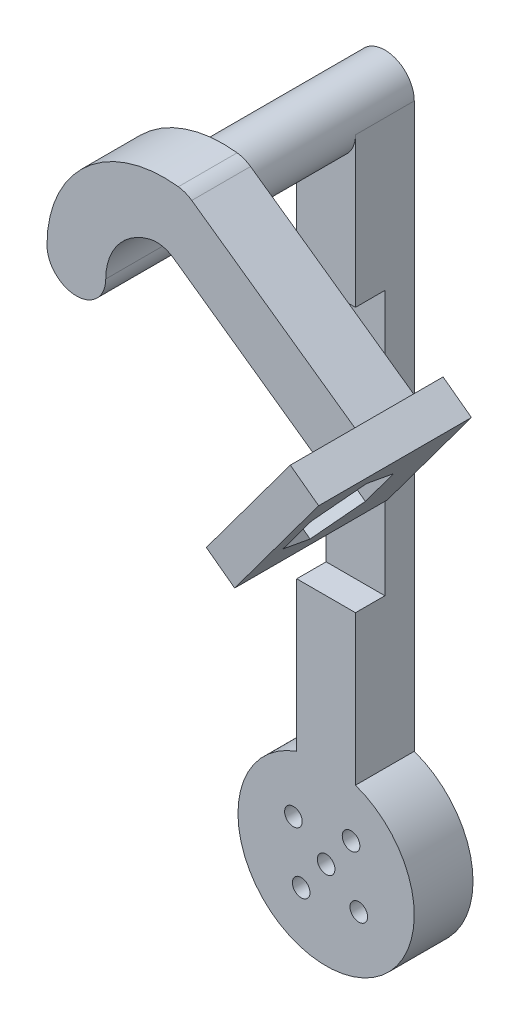
ISO-10303-21;
HEADER;
FILE_DESCRIPTION(('STEP AP214'),'2;1');
FILE_NAME('part.step','',(''),(''),'','','');
FILE_SCHEMA(('AUTOMOTIVE_DESIGN { 1 0 10303 214 1 1 1 1 }'));
ENDSEC;
DATA;
#1=APPLICATION_CONTEXT('core data for automotive mechanical design processes');
#2=APPLICATION_PROTOCOL_DEFINITION('international standard','automotive_design',2000,#1);
#3=PRODUCT_CONTEXT('',#1,'mechanical');
#4=PRODUCT('Part','Part','',(#3));
#5=PRODUCT_RELATED_PRODUCT_CATEGORY('part','',(#4));
#6=PRODUCT_DEFINITION_FORMATION('','',#4);
#7=PRODUCT_DEFINITION_CONTEXT('part definition',#1,'design');
#8=PRODUCT_DEFINITION('design','',#6,#7);
#9=PRODUCT_DEFINITION_SHAPE('','',#8);
#10=(LENGTH_UNIT() NAMED_UNIT(*) SI_UNIT(.MILLI.,.METRE.));
#11=(NAMED_UNIT(*) PLANE_ANGLE_UNIT() SI_UNIT($,.RADIAN.));
#12=(NAMED_UNIT(*) SI_UNIT($,.STERADIAN.) SOLID_ANGLE_UNIT());
#13=UNCERTAINTY_MEASURE_WITH_UNIT(LENGTH_MEASURE(1.E-05),#10,'distance_accuracy_value','');
#14=(GEOMETRIC_REPRESENTATION_CONTEXT(3) GLOBAL_UNCERTAINTY_ASSIGNED_CONTEXT((#13)) GLOBAL_UNIT_ASSIGNED_CONTEXT((#10,
#11,#12)) REPRESENTATION_CONTEXT('',''));
#15=CARTESIAN_POINT('',(0.,0.,0.));
#16=DIRECTION('',(0.,0.,1.));
#17=DIRECTION('',(1.,0.,0.));
#18=AXIS2_PLACEMENT_3D('',#15,#16,#17);
#19=CARTESIAN_POINT('',(-5.,70.,-42.5));
#20=DIRECTION('',(0.,0.,-1.));
#21=DIRECTION('',(1.,0.,0.));
#22=AXIS2_PLACEMENT_3D('',#19,#20,#21);
#23=PLANE('',#22);
#24=CARTESIAN_POINT('',(-4.99999999999998,-40.,-42.5));
#25=DIRECTION('',(0.,0.,-1.));
#26=DIRECTION('',(-1.,0.,0.));
#27=AXIS2_PLACEMENT_3D('',#24,#25,#26);
#28=CIRCLE('',#27,1.5);
#29=CARTESIAN_POINT('',(-6.49999999999998,-40.,-42.5));
#30=VERTEX_POINT('',#29);
#31=EDGE_CURVE('E345',#30,#30,#28,.T.);
#32=ORIENTED_EDGE('',*,*,#31,.T.);
#33=EDGE_LOOP('',(#32));
#34=FACE_BOUND('',#33,.T.);
#35=CARTESIAN_POINT('',(-10.5656613127386,-35.7546008253776,-42.5));
#36=DIRECTION('',(0.,0.,-1.));
#37=DIRECTION('',(-1.,0.,0.));
#38=AXIS2_PLACEMENT_3D('',#35,#36,#37);
#39=CIRCLE('',#38,1.5);
#40=CARTESIAN_POINT('',(-12.0656613127386,-35.7546008253776,-42.5));
#41=VERTEX_POINT('',#40);
#42=EDGE_CURVE('E346',#41,#41,#39,.T.);
#43=ORIENTED_EDGE('',*,*,#42,.T.);
#44=EDGE_LOOP('',(#43));
#45=FACE_BOUND('',#44,.T.);
#46=CARTESIAN_POINT('',(-0.754600825377485,-34.4343386872617,-42.5));
#47=DIRECTION('',(0.,0.,-1.));
#48=DIRECTION('',(-1.,0.,0.));
#49=AXIS2_PLACEMENT_3D('',#46,#47,#48);
#50=CIRCLE('',#49,1.50000000000032);
#51=CARTESIAN_POINT('',(-2.2546008253778,-34.4343386872617,-42.5));
#52=VERTEX_POINT('',#51);
#53=EDGE_CURVE('E352',#52,#52,#50,.T.);
#54=ORIENTED_EDGE('',*,*,#53,.T.);
#55=EDGE_LOOP('',(#54));
#56=FACE_BOUND('',#55,.T.);
#57=CARTESIAN_POINT('',(0.565661312738365,-44.2453991746228,-42.5));
#58=DIRECTION('',(0.,0.,-1.));
#59=DIRECTION('',(-1.,0.,0.));
#60=AXIS2_PLACEMENT_3D('',#57,#58,#59);
#61=CIRCLE('',#60,1.50000000000042);
#62=CARTESIAN_POINT('',(-0.934338687262058,-44.2453991746228,-42.5));
#63=VERTEX_POINT('',#62);
#64=EDGE_CURVE('E358',#63,#63,#61,.T.);
#65=ORIENTED_EDGE('',*,*,#64,.T.);
#66=EDGE_LOOP('',(#65));
#67=FACE_BOUND('',#66,.T.);
#68=CARTESIAN_POINT('',(-9.24539917462271,-45.5656613127386,-42.5));
#69=DIRECTION('',(0.,0.,-1.));
#70=DIRECTION('',(-1.,0.,0.));
#71=AXIS2_PLACEMENT_3D('',#68,#69,#70);
#72=CIRCLE('',#71,1.50000000000016);
#73=CARTESIAN_POINT('',(-10.7453991746229,-45.5656613127386,-42.5));
#74=VERTEX_POINT('',#73);
#75=EDGE_CURVE('E341',#74,#74,#72,.T.);
#76=ORIENTED_EDGE('',*,*,#75,.T.);
#77=EDGE_LOOP('',(#76));
#78=FACE_BOUND('',#77,.T.);
#79=DIRECTION('',(0.,-1.,0.));
#80=VECTOR('',#79,1.);
#81=CARTESIAN_POINT('',(-10.,70.,-42.5));
#82=LINE('',#81,#80);
#83=CARTESIAN_POINT('',(-10.,-0.428932188134513,-42.5));
#84=VERTEX_POINT('',#83);
#85=CARTESIAN_POINT('',(-9.99999999999999,-25.8578643762691,-42.5));
#86=VERTEX_POINT('',#85);
#87=EDGE_CURVE('E369',#84,#86,#82,.T.);
#88=ORIENTED_EDGE('',*,*,#87,.T.);
#89=CARTESIAN_POINT('',(-4.99999999999999,-40.,-42.5));
#90=DIRECTION('',(0.,0.,1.));
#91=DIRECTION('',(1.,0.,0.));
#92=AXIS2_PLACEMENT_3D('',#89,#90,#91);
#93=CIRCLE('',#92,15.);
#94=CARTESIAN_POINT('',(0.,-25.857864376269,-42.5));
#95=VERTEX_POINT('',#94);
#96=EDGE_CURVE('E388',#86,#95,#93,.T.);
#97=ORIENTED_EDGE('',*,*,#96,.T.);
#98=DIRECTION('',(0.,1.,0.));
#99=VECTOR('',#98,1.);
#100=CARTESIAN_POINT('',(0.,70.,-42.5));
#101=LINE('',#100,#99);
#102=CARTESIAN_POINT('',(0.,-0.428932188134511,-42.5));
#103=VERTEX_POINT('',#102);
#104=EDGE_CURVE('E376',#95,#103,#101,.T.);
#105=ORIENTED_EDGE('',*,*,#104,.T.);
#106=DIRECTION('',(-1.,0.,0.));
#107=VECTOR('',#106,1.);
#108=CARTESIAN_POINT('',(0.,-0.428932188134511,-42.5));
#109=LINE('',#108,#107);
#110=EDGE_CURVE('E232',#103,#84,#109,.T.);
#111=ORIENTED_EDGE('',*,*,#110,.T.);
#112=EDGE_LOOP('',(#88,#97,#105,#111));
#113=FACE_BOUND('',#112,.T.);
#114=ADVANCED_FACE('F37',(#34,#45,#56,#67,#78,#113),#23,.F.);
#115=CARTESIAN_POINT('',(46.8101040062718,66.1183287171004,-10.));
#116=DIRECTION('',(0.577822415053882,0.816162518534942,0.));
#117=DIRECTION('',(-0.816162518534942,0.577822415053882,0.));
#118=AXIS2_PLACEMENT_3D('',#115,#116,#117);
#119=PLANE('',#118);
#120=DIRECTION('',(0.816162518534942,-0.577822415053882,0.));
#121=VECTOR('',#120,1.);
#122=CARTESIAN_POINT('',(46.8101040062718,66.1183287171004,-10.));
#123=LINE('',#122,#121);
#124=CARTESIAN_POINT('',(14.6370161563222,88.8960609689677,-10.));
#125=VERTEX_POINT('',#124);
#126=CARTESIAN_POINT('',(43.2377237554058,68.6474835571825,-10.));
#127=VERTEX_POINT('',#126);
#128=EDGE_CURVE('E412',#125,#127,#123,.T.);
#129=ORIENTED_EDGE('',*,*,#128,.F.);
#130=DIRECTION('',(0.,0.,1.));
#131=VECTOR('',#130,1.);
#132=CARTESIAN_POINT('',(14.6370161563222,88.8960609689677,-10.));
#133=LINE('',#132,#131);
#134=CARTESIAN_POINT('',(14.6370161563222,88.8960609689677,0.));
#135=VERTEX_POINT('',#134);
#136=EDGE_CURVE('E457',#125,#135,#133,.T.);
#137=ORIENTED_EDGE('',*,*,#136,.T.);
#138=DIRECTION('',(0.816162518534942,-0.577822415053882,0.));
#139=VECTOR('',#138,1.);
#140=CARTESIAN_POINT('',(46.8101040062718,66.1183287171004,0.));
#141=LINE('',#140,#139);
#142=CARTESIAN_POINT('',(43.2377237554058,68.6474835571825,0.));
#143=VERTEX_POINT('',#142);
#144=EDGE_CURVE('E409',#135,#143,#141,.T.);
#145=ORIENTED_EDGE('',*,*,#144,.T.);
#146=DIRECTION('',(0.,0.,1.));
#147=VECTOR('',#146,1.);
#148=CARTESIAN_POINT('',(43.2377237554058,68.6474835571825,-10.));
#149=LINE('',#148,#147);
#150=EDGE_CURVE('E315',#127,#143,#149,.T.);
#151=ORIENTED_EDGE('',*,*,#150,.F.);
#152=EDGE_LOOP('',(#129,#137,#145,#151));
#153=FACE_BOUND('',#152,.T.);
#154=ADVANCED_FACE('F39',(#153),#119,.T.);
#155=CARTESIAN_POINT('',(41.031879855733,57.956703531751,-10.));
#156=DIRECTION('',(0.577822415053882,0.816162518534942,0.));
#157=DIRECTION('',(-0.816162518534942,0.577822415053882,0.));
#158=AXIS2_PLACEMENT_3D('',#155,#156,#157);
#159=PLANE('',#158);
#160=DIRECTION('',(0.,0.,1.));
#161=VECTOR('',#160,1.);
#162=CARTESIAN_POINT('',(37.282165609397,60.6114063542588,-10.));
#163=LINE('',#162,#161);
#164=CARTESIAN_POINT('',(37.282165609397,60.6114063542588,-10.));
#165=VERTEX_POINT('',#164);
#166=CARTESIAN_POINT('',(37.282165609397,60.6114063542588,0.));
#167=VERTEX_POINT('',#166);
#168=EDGE_CURVE('E312',#165,#167,#163,.T.);
#169=ORIENTED_EDGE('',*,*,#168,.T.);
#170=DIRECTION('',(0.816162518534942,-0.577822415053882,0.));
#171=VECTOR('',#170,1.);
#172=CARTESIAN_POINT('',(41.031879855733,57.956703531751,0.));
#173=LINE('',#172,#171);
#174=CARTESIAN_POINT('',(11.5366284211116,78.8385953480618,0.));
#175=VERTEX_POINT('',#174);
#176=EDGE_CURVE('E416',#175,#167,#173,.T.);
#177=ORIENTED_EDGE('',*,*,#176,.F.);
#178=DIRECTION('',(0.,0.,1.));
#179=VECTOR('',#178,1.);
#180=CARTESIAN_POINT('',(11.5366284211116,78.8385953480618,-10.));
#181=LINE('',#180,#179);
#182=CARTESIAN_POINT('',(11.5366284211116,78.8385953480618,-10.));
#183=VERTEX_POINT('',#182);
#184=EDGE_CURVE('E431',#183,#175,#181,.T.);
#185=ORIENTED_EDGE('',*,*,#184,.F.);
#186=DIRECTION('',(0.816162518534942,-0.577822415053882,0.));
#187=VECTOR('',#186,1.);
#188=CARTESIAN_POINT('',(41.031879855733,57.956703531751,-10.));
#189=LINE('',#188,#187);
#190=EDGE_CURVE('E428',#183,#165,#189,.T.);
#191=ORIENTED_EDGE('',*,*,#190,.T.);
#192=EDGE_LOOP('',(#169,#177,#185,#191));
#193=FACE_BOUND('',#192,.T.);
#194=ADVANCED_FACE('F502',(#193),#159,.F.);
#195=CARTESIAN_POINT('',(0.,0.,0.));
#196=DIRECTION('',(0.,0.,-1.));
#197=DIRECTION('',(1.,0.,0.));
#198=AXIS2_PLACEMENT_3D('',#195,#196,#197);
#199=PLANE('',#198);
#200=DIRECTION('',(0.595415284473228,0.803418097266713,0.));
#201=VECTOR('',#200,1.);
#202=CARTESIAN_POINT('',(47.4079851150517,74.2745870831456,0.));
#203=LINE('',#202,#201);
#204=CARTESIAN_POINT('',(37.3410147158261,60.6908138507508,0.));
#205=VERTEX_POINT('',#204);
#206=EDGE_CURVE('E45',#167,#205,#203,.T.);
#207=ORIENTED_EDGE('',*,*,#206,.T.);
#208=CARTESIAN_POINT('',(43.18498868692,68.5763259811395,0.));
#209=VERTEX_POINT('',#208);
#210=EDGE_CURVE('E332',#205,#209,#203,.T.);
#211=ORIENTED_EDGE('',*,*,#210,.T.);
#212=EDGE_CURVE('E333',#209,#143,#203,.T.);
#213=ORIENTED_EDGE('',*,*,#212,.T.);
#214=ORIENTED_EDGE('',*,*,#144,.F.);
#215=CARTESIAN_POINT('',(11.7479040810528,84.815248376293,0.));
#216=DIRECTION('',(0.,0.,1.));
#217=DIRECTION('',(1.,0.,0.));
#218=AXIS2_PLACEMENT_3D('',#215,#216,#217);
#219=CIRCLE('',#218,4.99999999999999);
#220=CARTESIAN_POINT('',(12.3579308203016,89.7778955909761,0.));
#221=VERTEX_POINT('',#220);
#222=EDGE_CURVE('E434',#135,#221,#219,.T.);
#223=ORIENTED_EDGE('',*,*,#222,.T.);
#224=CARTESIAN_POINT('',(9.92675958554832,70.,0.));
#225=DIRECTION('',(0.,0.,1.));
#226=DIRECTION('',(1.,0.,0.));
#227=AXIS2_PLACEMENT_3D('',#224,#225,#226);
#228=CIRCLE('',#227,19.9267595855483);
#229=CARTESIAN_POINT('',(-10.,70.,0.));
#230=VERTEX_POINT('',#229);
#231=EDGE_CURVE('E437',#230,#221,#228,.F.);
#232=ORIENTED_EDGE('',*,*,#231,.F.);
#233=CARTESIAN_POINT('',(-5.,70.,0.));
#234=DIRECTION('',(0.,0.,-1.));
#235=DIRECTION('',(1.,0.,0.));
#236=AXIS2_PLACEMENT_3D('',#233,#234,#235);
#237=CIRCLE('',#236,5.);
#238=CARTESIAN_POINT('',(0.,70.,0.));
#239=VERTEX_POINT('',#238);
#240=EDGE_CURVE('E402',#239,#230,#237,.T.);
#241=ORIENTED_EDGE('',*,*,#240,.F.);
#242=CARTESIAN_POINT('',(9.92675958554832,70.,0.));
#243=DIRECTION('',(0.,0.,1.));
#244=DIRECTION('',(1.,0.,0.));
#245=AXIS2_PLACEMENT_3D('',#242,#243,#244);
#246=CIRCLE('',#245,9.92675958554832);
#247=CARTESIAN_POINT('',(7.34925608218081,79.5862939428855,0.));
#248=VERTEX_POINT('',#247);
#249=EDGE_CURVE('E440',#239,#248,#246,.F.);
#250=ORIENTED_EDGE('',*,*,#249,.T.);
#251=CARTESIAN_POINT('',(8.64751634584223,74.7577827553871,0.));
#252=DIRECTION('',(0.,0.,1.));
#253=DIRECTION('',(1.,0.,0.));
#254=AXIS2_PLACEMENT_3D('',#251,#252,#253);
#255=CIRCLE('',#254,5.);
#256=EDGE_CURVE('E443',#175,#248,#255,.T.);
#257=ORIENTED_EDGE('',*,*,#256,.F.);
#258=ORIENTED_EDGE('',*,*,#176,.T.);
#259=EDGE_LOOP('',(#207,#211,#213,#214,#223,#232,#241,#250,#257,#258));
#260=FACE_BOUND('',#259,.T.);
#261=ADVANCED_FACE('F467',(#260),#199,.F.);
#262=CARTESIAN_POINT('',(0.,0.,-10.));
#263=DIRECTION('',(0.,0.,-1.));
#264=DIRECTION('',(1.,0.,0.));
#265=AXIS2_PLACEMENT_3D('',#262,#263,#264);
#266=PLANE('',#265);
#267=ORIENTED_EDGE('',*,*,#190,.F.);
#268=CARTESIAN_POINT('',(8.64751634584223,74.7577827553871,-10.));
#269=DIRECTION('',(0.,0.,1.));
#270=DIRECTION('',(1.,0.,0.));
#271=AXIS2_PLACEMENT_3D('',#268,#269,#270);
#272=CIRCLE('',#271,5.);
#273=CARTESIAN_POINT('',(7.34925608218081,79.5862939428855,-10.));
#274=VERTEX_POINT('',#273);
#275=EDGE_CURVE('E425',#183,#274,#272,.T.);
#276=ORIENTED_EDGE('',*,*,#275,.T.);
#277=CARTESIAN_POINT('',(9.92675958554832,70.,-10.));
#278=DIRECTION('',(0.,0.,1.));
#279=DIRECTION('',(1.,0.,0.));
#280=AXIS2_PLACEMENT_3D('',#277,#278,#279);
#281=CIRCLE('',#280,9.92675958554832);
#282=CARTESIAN_POINT('',(0.,70.,-10.));
#283=VERTEX_POINT('',#282);
#284=EDGE_CURVE('E422',#283,#274,#281,.F.);
#285=ORIENTED_EDGE('',*,*,#284,.F.);
#286=CARTESIAN_POINT('',(-5.,70.,-10.));
#287=DIRECTION('',(0.,0.,1.));
#288=DIRECTION('',(1.,0.,0.));
#289=AXIS2_PLACEMENT_3D('',#286,#287,#288);
#290=CIRCLE('',#289,5.00000000000001);
#291=CARTESIAN_POINT('',(-10.,70.,-10.));
#292=VERTEX_POINT('',#291);
#293=EDGE_CURVE('E405',#283,#292,#290,.T.);
#294=ORIENTED_EDGE('',*,*,#293,.T.);
#295=CARTESIAN_POINT('',(9.92675958554832,70.,-10.));
#296=DIRECTION('',(0.,0.,1.));
#297=DIRECTION('',(1.,0.,0.));
#298=AXIS2_PLACEMENT_3D('',#295,#296,#297);
#299=CIRCLE('',#298,19.9267595855483);
#300=CARTESIAN_POINT('',(12.3579308203016,89.7778955909761,-10.));
#301=VERTEX_POINT('',#300);
#302=EDGE_CURVE('E419',#292,#301,#299,.F.);
#303=ORIENTED_EDGE('',*,*,#302,.T.);
#304=CARTESIAN_POINT('',(11.7479040810528,84.815248376293,-10.));
#305=DIRECTION('',(0.,0.,1.));
#306=DIRECTION('',(1.,0.,0.));
#307=AXIS2_PLACEMENT_3D('',#304,#305,#306);
#308=CIRCLE('',#307,4.99999999999999);
#309=EDGE_CURVE('E415',#125,#301,#308,.T.);
#310=ORIENTED_EDGE('',*,*,#309,.F.);
#311=ORIENTED_EDGE('',*,*,#128,.T.);
#312=DIRECTION('',(-0.595415284473228,-0.803418097266713,0.));
#313=VECTOR('',#312,1.);
#314=CARTESIAN_POINT('',(-4.92960569182014,3.65334386332791,-10.));
#315=LINE('',#314,#313);
#316=CARTESIAN_POINT('',(47.4079851150517,74.2745870831456,-10.));
#317=VERTEX_POINT('',#316);
#318=EDGE_CURVE('E301',#317,#127,#315,.T.);
#319=ORIENTED_EDGE('',*,*,#318,.F.);
#320=DIRECTION('',(-0.803418097266713,0.595415284473228,0.));
#321=VECTOR('',#320,1.);
#322=CARTESIAN_POINT('',(52.3375908068718,70.6212432198177,-10.));
#323=LINE('',#322,#321);
#324=CARTESIAN_POINT('',(52.2284936986519,70.7020953763062,-10.));
#325=VERTEX_POINT('',#324);
#326=EDGE_CURVE('E298',#325,#317,#323,.T.);
#327=ORIENTED_EDGE('',*,*,#326,.F.);
#328=DIRECTION('',(0.595415284473228,0.803418097266712,0.));
#329=VECTOR('',#328,1.);
#330=CARTESIAN_POINT('',(-0.109097108219928,0.0808521564885917,-10.));
#331=LINE('',#330,#329);
#332=CARTESIAN_POINT('',(37.9385268712945,51.4200610419051,-10.));
#333=VERTEX_POINT('',#332);
#334=EDGE_CURVE('E309',#333,#325,#331,.T.);
#335=ORIENTED_EDGE('',*,*,#334,.F.);
#336=DIRECTION('',(0.803418097266713,-0.595415284473228,0.));
#337=VECTOR('',#336,1.);
#338=CARTESIAN_POINT('',(38.0476239795144,51.3392088854166,-10.));
#339=LINE('',#338,#337);
#340=CARTESIAN_POINT('',(33.1180182876942,54.9925527487445,-10.));
#341=VERTEX_POINT('',#340);
#342=EDGE_CURVE('E306',#341,#333,#339,.T.);
#343=ORIENTED_EDGE('',*,*,#342,.F.);
#344=DIRECTION('',(-0.595415284473228,-0.803418097266713,0.));
#345=VECTOR('',#344,1.);
#346=CARTESIAN_POINT('',(-4.92960569182014,3.65334386332791,-10.));
#347=LINE('',#346,#345);
#348=EDGE_CURVE('E303',#165,#341,#347,.T.);
#349=ORIENTED_EDGE('',*,*,#348,.F.);
#350=EDGE_LOOP('',(#267,#276,#285,#294,#303,#310,#311,#319,#327,#335,#343,#349));
#351=FACE_BOUND('',#350,.T.);
#352=ADVANCED_FACE('F807',(#351),#266,.T.);
#353=CARTESIAN_POINT('',(11.7479040810528,84.815248376293,-10.));
#354=DIRECTION('',(0.,0.,1.));
#355=DIRECTION('',(-1.,0.,0.));
#356=AXIS2_PLACEMENT_3D('',#353,#354,#355);
#357=CYLINDRICAL_SURFACE('',#356,4.99999999999999);
#358=ORIENTED_EDGE('',*,*,#222,.F.);
#359=ORIENTED_EDGE('',*,*,#136,.F.);
#360=ORIENTED_EDGE('',*,*,#309,.T.);
#361=DIRECTION('',(0.,0.,1.));
#362=VECTOR('',#361,1.);
#363=CARTESIAN_POINT('',(12.3579308203016,89.7778955909761,-10.));
#364=LINE('',#363,#362);
#365=EDGE_CURVE('E456',#301,#221,#364,.T.);
#366=ORIENTED_EDGE('',*,*,#365,.T.);
#367=EDGE_LOOP('',(#358,#359,#360,#366));
#368=FACE_BOUND('',#367,.T.);
#369=ADVANCED_FACE('F485',(#368),#357,.T.);
#370=CARTESIAN_POINT('',(9.92675958554832,70.,-10.));
#371=DIRECTION('',(0.,0.,1.));
#372=DIRECTION('',(-1.,0.,0.));
#373=AXIS2_PLACEMENT_3D('',#370,#371,#372);
#374=CYLINDRICAL_SURFACE('',#373,19.9267595855483);
#375=ORIENTED_EDGE('',*,*,#231,.T.);
#376=ORIENTED_EDGE('',*,*,#365,.F.);
#377=ORIENTED_EDGE('',*,*,#302,.F.);
#378=DIRECTION('',(0.,0.,1.));
#379=VECTOR('',#378,1.);
#380=CARTESIAN_POINT('',(-10.,70.,-10.));
#381=LINE('',#380,#379);
#382=EDGE_CURVE('E454',#292,#230,#381,.T.);
#383=ORIENTED_EDGE('',*,*,#382,.T.);
#384=EDGE_LOOP('',(#375,#376,#377,#383));
#385=FACE_BOUND('',#384,.T.);
#386=ADVANCED_FACE('F488',(#385),#374,.T.);
#387=CARTESIAN_POINT('',(9.92675958554832,70.,-10.));
#388=DIRECTION('',(0.,0.,1.));
#389=DIRECTION('',(-1.,0.,0.));
#390=AXIS2_PLACEMENT_3D('',#387,#388,#389);
#391=CYLINDRICAL_SURFACE('',#390,9.92675958554832);
#392=ORIENTED_EDGE('',*,*,#249,.F.);
#393=DIRECTION('',(0.,0.,1.));
#394=VECTOR('',#393,1.);
#395=CARTESIAN_POINT('',(0.,70.,-10.));
#396=LINE('',#395,#394);
#397=EDGE_CURVE('E452',#283,#239,#396,.T.);
#398=ORIENTED_EDGE('',*,*,#397,.F.);
#399=ORIENTED_EDGE('',*,*,#284,.T.);
#400=DIRECTION('',(0.,0.,1.));
#401=VECTOR('',#400,1.);
#402=CARTESIAN_POINT('',(7.34925608218081,79.5862939428855,-10.));
#403=LINE('',#402,#401);
#404=EDGE_CURVE('E450',#274,#248,#403,.T.);
#405=ORIENTED_EDGE('',*,*,#404,.T.);
#406=EDGE_LOOP('',(#392,#398,#399,#405));
#407=FACE_BOUND('',#406,.T.);
#408=ADVANCED_FACE('F494',(#407),#391,.F.);
#409=CARTESIAN_POINT('',(8.64751634584223,74.7577827553871,-10.));
#410=DIRECTION('',(0.,0.,1.));
#411=DIRECTION('',(-1.,0.,0.));
#412=AXIS2_PLACEMENT_3D('',#409,#410,#411);
#413=CYLINDRICAL_SURFACE('',#412,5.);
#414=ORIENTED_EDGE('',*,*,#256,.T.);
#415=ORIENTED_EDGE('',*,*,#404,.F.);
#416=ORIENTED_EDGE('',*,*,#275,.F.);
#417=ORIENTED_EDGE('',*,*,#184,.T.);
#418=EDGE_LOOP('',(#414,#415,#416,#417));
#419=FACE_BOUND('',#418,.T.);
#420=ADVANCED_FACE('F497',(#419),#413,.F.);
#421=CARTESIAN_POINT('',(-5.,70.,-42.5));
#422=DIRECTION('',(0.,0.,1.));
#423=DIRECTION('',(-1.,0.,0.));
#424=AXIS2_PLACEMENT_3D('',#421,#422,#423);
#425=CYLINDRICAL_SURFACE('',#424,5.00000000000001);
#426=CARTESIAN_POINT('',(-5.,70.,-42.5));
#427=DIRECTION('',(0.,0.,1.));
#428=DIRECTION('',(1.,0.,0.));
#429=AXIS2_PLACEMENT_3D('',#426,#427,#428);
#430=CIRCLE('',#429,5.00000000000001);
#431=CARTESIAN_POINT('',(-10.,70.,-42.5));
#432=VERTEX_POINT('',#431);
#433=CARTESIAN_POINT('',(0.,70.,-42.5));
#434=VERTEX_POINT('',#433);
#435=EDGE_CURVE('E406',#432,#434,#430,.T.);
#436=ORIENTED_EDGE('',*,*,#435,.T.);
#437=DIRECTION('',(0.,0.,1.));
#438=VECTOR('',#437,1.);
#439=CARTESIAN_POINT('',(0.,70.,-52.5));
#440=LINE('',#439,#438);
#441=CARTESIAN_POINT('',(0.,70.,-52.5));
#442=VERTEX_POINT('',#441);
#443=EDGE_CURVE('E384',#442,#434,#440,.T.);
#444=ORIENTED_EDGE('',*,*,#443,.F.);
#445=CARTESIAN_POINT('',(-5.,70.,-52.5));
#446=DIRECTION('',(0.,0.,1.));
#447=DIRECTION('',(1.,0.,0.));
#448=AXIS2_PLACEMENT_3D('',#445,#446,#447);
#449=CIRCLE('',#448,5.00000000000001);
#450=CARTESIAN_POINT('',(-10.,70.,-52.5));
#451=VERTEX_POINT('',#450);
#452=EDGE_CURVE('E372',#442,#451,#449,.T.);
#453=ORIENTED_EDGE('',*,*,#452,.T.);
#454=DIRECTION('',(0.,0.,1.));
#455=VECTOR('',#454,1.);
#456=CARTESIAN_POINT('',(-10.,70.,-52.5));
#457=LINE('',#456,#455);
#458=EDGE_CURVE('E399',#451,#432,#457,.T.);
#459=ORIENTED_EDGE('',*,*,#458,.T.);
#460=EDGE_LOOP('',(#436,#444,#453,#459));
#461=FACE_BOUND('',#460,.T.);
#462=ORIENTED_EDGE('',*,*,#293,.F.);
#463=ORIENTED_EDGE('',*,*,#397,.T.);
#464=ORIENTED_EDGE('',*,*,#240,.T.);
#465=ORIENTED_EDGE('',*,*,#382,.F.);
#466=EDGE_LOOP('',(#462,#463,#464,#465));
#467=FACE_BOUND('',#466,.T.);
#468=ADVANCED_FACE('F491',(#461,#467),#425,.T.);
#469=CARTESIAN_POINT('',(0.,44.5710678118655,-42.5));
#470=VERTEX_POINT('',#469);
#471=EDGE_CURVE('E391',#470,#434,#101,.T.);
#472=ORIENTED_EDGE('',*,*,#471,.T.);
#473=ORIENTED_EDGE('',*,*,#435,.F.);
#474=CARTESIAN_POINT('',(-10.,44.5710678118655,-42.5));
#475=VERTEX_POINT('',#474);
#476=EDGE_CURVE('E385',#432,#475,#82,.T.);
#477=ORIENTED_EDGE('',*,*,#476,.T.);
#478=DIRECTION('',(-1.,0.,0.));
#479=VECTOR('',#478,1.);
#480=CARTESIAN_POINT('',(0.,44.5710678118655,-42.5));
#481=LINE('',#480,#479);
#482=EDGE_CURVE('E249',#470,#475,#481,.T.);
#483=ORIENTED_EDGE('',*,*,#482,.F.);
#484=EDGE_LOOP('',(#472,#473,#477,#483));
#485=FACE_BOUND('',#484,.T.);
#486=ADVANCED_FACE('F538',(#485),#23,.F.);
#487=CARTESIAN_POINT('',(-10.,70.,-52.5));
#488=DIRECTION('',(1.,0.,0.));
#489=DIRECTION('',(0.,1.,0.));
#490=AXIS2_PLACEMENT_3D('',#487,#488,#489);
#491=PLANE('',#490);
#492=DIRECTION('',(0.,1.,0.));
#493=VECTOR('',#492,1.);
#494=CARTESIAN_POINT('',(-10.,44.5710678118655,-47.5));
#495=LINE('',#494,#493);
#496=CARTESIAN_POINT('',(-10.,-0.428932188134523,-47.5));
#497=VERTEX_POINT('',#496);
#498=CARTESIAN_POINT('',(-10.,44.5710678118655,-47.5));
#499=VERTEX_POINT('',#498);
#500=EDGE_CURVE('E223',#497,#499,#495,.T.);
#501=ORIENTED_EDGE('',*,*,#500,.T.);
#502=DIRECTION('',(0.,0.,1.));
#503=VECTOR('',#502,1.);
#504=CARTESIAN_POINT('',(-10.,44.5710678118655,-47.5));
#505=LINE('',#504,#503);
#506=EDGE_CURVE('E236',#499,#475,#505,.T.);
#507=ORIENTED_EDGE('',*,*,#506,.T.);
#508=ORIENTED_EDGE('',*,*,#476,.F.);
#509=ORIENTED_EDGE('',*,*,#458,.F.);
#510=DIRECTION('',(0.,-1.,0.));
#511=VECTOR('',#510,1.);
#512=CARTESIAN_POINT('',(-10.,70.,-52.5));
#513=LINE('',#512,#511);
#514=CARTESIAN_POINT('',(-9.99999999999999,-25.8578643762691,-52.5));
#515=VERTEX_POINT('',#514);
#516=EDGE_CURVE('E375',#451,#515,#513,.T.);
#517=ORIENTED_EDGE('',*,*,#516,.T.);
#518=DIRECTION('',(0.,0.,1.));
#519=VECTOR('',#518,1.);
#520=CARTESIAN_POINT('',(-9.99999999999999,-25.8578643762691,-52.5));
#521=LINE('',#520,#519);
#522=EDGE_CURVE('E397',#515,#86,#521,.T.);
#523=ORIENTED_EDGE('',*,*,#522,.T.);
#524=ORIENTED_EDGE('',*,*,#87,.F.);
#525=DIRECTION('',(0.,0.,-1.));
#526=VECTOR('',#525,1.);
#527=CARTESIAN_POINT('',(-10.,-0.428932188134513,-42.5));
#528=LINE('',#527,#526);
#529=EDGE_CURVE('E243',#84,#497,#528,.T.);
#530=ORIENTED_EDGE('',*,*,#529,.T.);
#531=EDGE_LOOP('',(#501,#507,#508,#509,#517,#523,#524,#530));
#532=FACE_BOUND('',#531,.T.);
#533=ADVANCED_FACE('F546',(#532),#491,.F.);
#534=CARTESIAN_POINT('',(-4.99999999999999,-40.,-52.5));
#535=DIRECTION('',(0.,0.,1.));
#536=DIRECTION('',(-1.,0.,0.));
#537=AXIS2_PLACEMENT_3D('',#534,#535,#536);
#538=CYLINDRICAL_SURFACE('',#537,15.);
#539=ORIENTED_EDGE('',*,*,#96,.F.);
#540=ORIENTED_EDGE('',*,*,#522,.F.);
#541=CARTESIAN_POINT('',(-4.99999999999999,-40.,-52.5));
#542=DIRECTION('',(0.,0.,1.));
#543=DIRECTION('',(1.,0.,0.));
#544=AXIS2_PLACEMENT_3D('',#541,#542,#543);
#545=CIRCLE('',#544,15.);
#546=CARTESIAN_POINT('',(0.,-25.857864376269,-52.5));
#547=VERTEX_POINT('',#546);
#548=EDGE_CURVE('E379',#515,#547,#545,.T.);
#549=ORIENTED_EDGE('',*,*,#548,.T.);
#550=DIRECTION('',(0.,0.,1.));
#551=VECTOR('',#550,1.);
#552=CARTESIAN_POINT('',(0.,-25.857864376269,-52.5));
#553=LINE('',#552,#551);
#554=EDGE_CURVE('E395',#547,#95,#553,.T.);
#555=ORIENTED_EDGE('',*,*,#554,.T.);
#556=EDGE_LOOP('',(#539,#540,#549,#555));
#557=FACE_BOUND('',#556,.T.);
#558=ADVANCED_FACE('F552',(#557),#538,.T.);
#559=CARTESIAN_POINT('',(0.,70.,-52.5));
#560=DIRECTION('',(-1.,0.,0.));
#561=DIRECTION('',(0.,-1.,0.));
#562=AXIS2_PLACEMENT_3D('',#559,#560,#561);
#563=PLANE('',#562);
#564=ORIENTED_EDGE('',*,*,#104,.F.);
#565=ORIENTED_EDGE('',*,*,#554,.F.);
#566=DIRECTION('',(0.,1.,0.));
#567=VECTOR('',#566,1.);
#568=CARTESIAN_POINT('',(0.,70.,-52.5));
#569=LINE('',#568,#567);
#570=EDGE_CURVE('E382',#547,#442,#569,.T.);
#571=ORIENTED_EDGE('',*,*,#570,.T.);
#572=ORIENTED_EDGE('',*,*,#443,.T.);
#573=ORIENTED_EDGE('',*,*,#471,.F.);
#574=DIRECTION('',(0.,0.,1.));
#575=VECTOR('',#574,1.);
#576=CARTESIAN_POINT('',(0.,44.5710678118655,-47.5));
#577=LINE('',#576,#575);
#578=CARTESIAN_POINT('',(0.,44.5710678118655,-47.5));
#579=VERTEX_POINT('',#578);
#580=EDGE_CURVE('E226',#579,#470,#577,.T.);
#581=ORIENTED_EDGE('',*,*,#580,.F.);
#582=DIRECTION('',(0.,1.,0.));
#583=VECTOR('',#582,1.);
#584=CARTESIAN_POINT('',(0.,44.5710678118655,-47.5));
#585=LINE('',#584,#583);
#586=CARTESIAN_POINT('',(0.,-0.428932188134522,-47.5));
#587=VERTEX_POINT('',#586);
#588=EDGE_CURVE('E220',#587,#579,#585,.T.);
#589=ORIENTED_EDGE('',*,*,#588,.F.);
#590=DIRECTION('',(0.,0.,-1.));
#591=VECTOR('',#590,1.);
#592=CARTESIAN_POINT('',(0.,-0.428932188134511,-42.5));
#593=LINE('',#592,#591);
#594=EDGE_CURVE('E229',#103,#587,#593,.T.);
#595=ORIENTED_EDGE('',*,*,#594,.F.);
#596=EDGE_LOOP('',(#564,#565,#571,#572,#573,#581,#589,#595));
#597=FACE_BOUND('',#596,.T.);
#598=ADVANCED_FACE('F238',(#597),#563,.F.);
#599=CARTESIAN_POINT('',(-5.,70.,-52.5));
#600=DIRECTION('',(0.,0.,-1.));
#601=DIRECTION('',(1.,0.,0.));
#602=AXIS2_PLACEMENT_3D('',#599,#600,#601);
#603=PLANE('',#602);
#604=CARTESIAN_POINT('',(-9.24539917462271,-45.5656613127386,-52.5));
#605=DIRECTION('',(0.,0.,-1.));
#606=DIRECTION('',(-1.,0.,0.));
#607=AXIS2_PLACEMENT_3D('',#604,#605,#606);
#608=CIRCLE('',#607,1.50000000000016);
#609=CARTESIAN_POINT('',(-10.7453991746229,-45.5656613127386,-52.5));
#610=VERTEX_POINT('',#609);
#611=EDGE_CURVE('E361',#610,#610,#608,.T.);
#612=ORIENTED_EDGE('',*,*,#611,.F.);
#613=EDGE_LOOP('',(#612));
#614=FACE_BOUND('',#613,.T.);
#615=CARTESIAN_POINT('',(0.565661312738365,-44.2453991746228,-52.5));
#616=DIRECTION('',(0.,0.,-1.));
#617=DIRECTION('',(-1.,0.,0.));
#618=AXIS2_PLACEMENT_3D('',#615,#616,#617);
#619=CIRCLE('',#618,1.50000000000042);
#620=CARTESIAN_POINT('',(-0.934338687262058,-44.2453991746228,-52.5));
#621=VERTEX_POINT('',#620);
#622=EDGE_CURVE('E355',#621,#621,#619,.T.);
#623=ORIENTED_EDGE('',*,*,#622,.F.);
#624=EDGE_LOOP('',(#623));
#625=FACE_BOUND('',#624,.T.);
#626=CARTESIAN_POINT('',(-0.754600825377485,-34.4343386872617,-52.5));
#627=DIRECTION('',(0.,0.,-1.));
#628=DIRECTION('',(-1.,0.,0.));
#629=AXIS2_PLACEMENT_3D('',#626,#627,#628);
#630=CIRCLE('',#629,1.50000000000032);
#631=CARTESIAN_POINT('',(-2.2546008253778,-34.4343386872617,-52.5));
#632=VERTEX_POINT('',#631);
#633=EDGE_CURVE('E349',#632,#632,#630,.T.);
#634=ORIENTED_EDGE('',*,*,#633,.F.);
#635=EDGE_LOOP('',(#634));
#636=FACE_BOUND('',#635,.T.);
#637=CARTESIAN_POINT('',(-10.5656613127386,-35.7546008253776,-52.5));
#638=DIRECTION('',(0.,0.,-1.));
#639=DIRECTION('',(-1.,0.,0.));
#640=AXIS2_PLACEMENT_3D('',#637,#638,#639);
#641=CIRCLE('',#640,1.5);
#642=CARTESIAN_POINT('',(-12.0656613127386,-35.7546008253776,-52.5));
#643=VERTEX_POINT('',#642);
#644=EDGE_CURVE('E342',#643,#643,#641,.T.);
#645=ORIENTED_EDGE('',*,*,#644,.F.);
#646=EDGE_LOOP('',(#645));
#647=FACE_BOUND('',#646,.T.);
#648=CARTESIAN_POINT('',(-4.99999999999998,-40.,-52.5));
#649=DIRECTION('',(0.,0.,-1.));
#650=DIRECTION('',(-1.,0.,0.));
#651=AXIS2_PLACEMENT_3D('',#648,#649,#650);
#652=CIRCLE('',#651,1.5);
#653=CARTESIAN_POINT('',(-6.49999999999998,-40.,-52.5));
#654=VERTEX_POINT('',#653);
#655=EDGE_CURVE('E366',#654,#654,#652,.T.);
#656=ORIENTED_EDGE('',*,*,#655,.F.);
#657=EDGE_LOOP('',(#656));
#658=FACE_BOUND('',#657,.T.);
#659=ORIENTED_EDGE('',*,*,#452,.F.);
#660=ORIENTED_EDGE('',*,*,#570,.F.);
#661=ORIENTED_EDGE('',*,*,#548,.F.);
#662=ORIENTED_EDGE('',*,*,#516,.F.);
#663=EDGE_LOOP('',(#659,#660,#661,#662));
#664=FACE_BOUND('',#663,.T.);
#665=ADVANCED_FACE('F730',(#614,#625,#636,#647,#658,#664),#603,.T.);
#666=CARTESIAN_POINT('',(-4.99999999999998,-40.,-52.5));
#667=DIRECTION('',(0.,0.,1.));
#668=DIRECTION('',(-1.,0.,0.));
#669=AXIS2_PLACEMENT_3D('',#666,#667,#668);
#670=CYLINDRICAL_SURFACE('',#669,1.5);
#671=ORIENTED_EDGE('',*,*,#655,.T.);
#672=EDGE_LOOP('',(#671));
#673=FACE_BOUND('',#672,.T.);
#674=ORIENTED_EDGE('',*,*,#31,.F.);
#675=EDGE_LOOP('',(#674));
#676=FACE_BOUND('',#675,.T.);
#677=ADVANCED_FACE('F720',(#673,#676),#670,.F.);
#678=CARTESIAN_POINT('',(-10.5656613127386,-35.7546008253776,-52.5));
#679=DIRECTION('',(0.,0.,1.));
#680=DIRECTION('',(-1.,0.,0.));
#681=AXIS2_PLACEMENT_3D('',#678,#679,#680);
#682=CYLINDRICAL_SURFACE('',#681,1.5);
#683=ORIENTED_EDGE('',*,*,#644,.T.);
#684=EDGE_LOOP('',(#683));
#685=FACE_BOUND('',#684,.T.);
#686=ORIENTED_EDGE('',*,*,#42,.F.);
#687=EDGE_LOOP('',(#686));
#688=FACE_BOUND('',#687,.T.);
#689=ADVANCED_FACE('F710',(#685,#688),#682,.F.);
#690=CARTESIAN_POINT('',(-0.754600825377485,-34.4343386872617,-52.5));
#691=DIRECTION('',(0.,0.,1.));
#692=DIRECTION('',(-1.,0.,0.));
#693=AXIS2_PLACEMENT_3D('',#690,#691,#692);
#694=CYLINDRICAL_SURFACE('',#693,1.50000000000032);
#695=ORIENTED_EDGE('',*,*,#633,.T.);
#696=EDGE_LOOP('',(#695));
#697=FACE_BOUND('',#696,.T.);
#698=ORIENTED_EDGE('',*,*,#53,.F.);
#699=EDGE_LOOP('',(#698));
#700=FACE_BOUND('',#699,.T.);
#701=ADVANCED_FACE('F700',(#697,#700),#694,.F.);
#702=CARTESIAN_POINT('',(0.565661312738365,-44.2453991746228,-52.5));
#703=DIRECTION('',(0.,0.,1.));
#704=DIRECTION('',(-1.,0.,0.));
#705=AXIS2_PLACEMENT_3D('',#702,#703,#704);
#706=CYLINDRICAL_SURFACE('',#705,1.50000000000042);
#707=ORIENTED_EDGE('',*,*,#622,.T.);
#708=EDGE_LOOP('',(#707));
#709=FACE_BOUND('',#708,.T.);
#710=ORIENTED_EDGE('',*,*,#64,.F.);
#711=EDGE_LOOP('',(#710));
#712=FACE_BOUND('',#711,.T.);
#713=ADVANCED_FACE('F689',(#709,#712),#706,.F.);
#714=CARTESIAN_POINT('',(-9.24539917462271,-45.5656613127386,-52.5));
#715=DIRECTION('',(0.,0.,1.));
#716=DIRECTION('',(-1.,0.,0.));
#717=AXIS2_PLACEMENT_3D('',#714,#715,#716);
#718=CYLINDRICAL_SURFACE('',#717,1.50000000000016);
#719=ORIENTED_EDGE('',*,*,#611,.T.);
#720=EDGE_LOOP('',(#719));
#721=FACE_BOUND('',#720,.T.);
#722=ORIENTED_EDGE('',*,*,#75,.F.);
#723=EDGE_LOOP('',(#722));
#724=FACE_BOUND('',#723,.T.);
#725=ADVANCED_FACE('F678',(#721,#724),#718,.F.);
#726=CARTESIAN_POINT('',(52.2284936986519,70.7020953763062,16.));
#727=DIRECTION('',(-0.803418097266712,0.595415284473228,0.));
#728=DIRECTION('',(-0.595415284473228,-0.803418097266713,0.));
#729=AXIS2_PLACEMENT_3D('',#726,#727,#728);
#730=PLANE('',#729);
#731=DIRECTION('',(0.595415284473229,0.803418097266712,0.));
#732=VECTOR('',#731,1.);
#733=CARTESIAN_POINT('',(42.6771680615817,57.8141026260045,12.5000000000001));
#734=LINE('',#733,#732);
#735=CARTESIAN_POINT('',(42.6771680615816,57.8141026260045,12.5000000000001));
#736=VERTEX_POINT('',#735);
#737=CARTESIAN_POINT('',(47.489852508365,64.308053792207,12.5000000000001));
#738=VERTEX_POINT('',#737);
#739=EDGE_CURVE('E271',#736,#738,#734,.T.);
#740=ORIENTED_EDGE('',*,*,#739,.T.);
#741=DIRECTION('',(0.297707642236612,0.401709048633354,-0.86602540378444));
#742=VECTOR('',#741,1.);
#743=CARTESIAN_POINT('',(47.489852508365,64.308053792207,12.5000000000001));
#744=LINE('',#743,#742);
#745=CARTESIAN_POINT('',(49.8961947317566,67.5550293753083,5.50000000000011));
#746=VERTEX_POINT('',#745);
#747=EDGE_CURVE('E274',#738,#746,#744,.T.);
#748=ORIENTED_EDGE('',*,*,#747,.T.);
#749=DIRECTION('',(-0.297707642236617,-0.401709048633361,-0.866025403784436));
#750=VECTOR('',#749,1.);
#751=CARTESIAN_POINT('',(49.8961947317566,67.5550293753083,5.50000000000011));
#752=LINE('',#751,#750);
#753=CARTESIAN_POINT('',(47.4898525083649,64.308053792207,-1.49999999999988));
#754=VERTEX_POINT('',#753);
#755=EDGE_CURVE('E277',#746,#754,#752,.T.);
#756=ORIENTED_EDGE('',*,*,#755,.T.);
#757=DIRECTION('',(-0.595415284473229,-0.803418097266712,0.));
#758=VECTOR('',#757,1.);
#759=CARTESIAN_POINT('',(47.4898525083649,64.308053792207,-1.49999999999988));
#760=LINE('',#759,#758);
#761=CARTESIAN_POINT('',(42.6771680615816,57.8141026260045,-1.49999999999981));
#762=VERTEX_POINT('',#761);
#763=EDGE_CURVE('E280',#754,#762,#760,.T.);
#764=ORIENTED_EDGE('',*,*,#763,.T.);
#765=DIRECTION('',(-0.297707642236609,-0.401709048633348,0.866025403784444));
#766=VECTOR('',#765,1.);
#767=CARTESIAN_POINT('',(42.6771680615816,57.8141026260045,-1.49999999999981));
#768=LINE('',#767,#766);
#769=CARTESIAN_POINT('',(40.27082583819,54.5671270429032,5.50000000000025));
#770=VERTEX_POINT('',#769);
#771=EDGE_CURVE('E283',#762,#770,#768,.T.);
#772=ORIENTED_EDGE('',*,*,#771,.T.);
#773=DIRECTION('',(0.297707642236617,0.401709048633361,0.866025403784435));
#774=VECTOR('',#773,1.);
#775=CARTESIAN_POINT('',(40.27082583819,54.5671270429032,5.50000000000025));
#776=LINE('',#775,#774);
#777=EDGE_CURVE('E248',#770,#736,#776,.T.);
#778=ORIENTED_EDGE('',*,*,#777,.T.);
#779=EDGE_LOOP('',(#740,#748,#756,#764,#772,#778));
#780=FACE_BOUND('',#779,.T.);
#781=DIRECTION('',(0.,0.,-1.));
#782=VECTOR('',#781,1.);
#783=CARTESIAN_POINT('',(52.2284936986519,70.7020953763062,16.));
#784=LINE('',#783,#782);
#785=CARTESIAN_POINT('',(52.2284936986519,70.7020953763062,16.));
#786=VERTEX_POINT('',#785);
#787=EDGE_CURVE('E329',#786,#325,#784,.T.);
#788=ORIENTED_EDGE('',*,*,#787,.F.);
#789=DIRECTION('',(-0.595415284473228,-0.803418097266712,0.));
#790=VECTOR('',#789,1.);
#791=CARTESIAN_POINT('',(52.2284936986519,70.7020953763062,16.));
#792=LINE('',#791,#790);
#793=CARTESIAN_POINT('',(37.9385268712945,51.4200610419051,16.));
#794=VERTEX_POINT('',#793);
#795=EDGE_CURVE('E318',#786,#794,#792,.T.);
#796=ORIENTED_EDGE('',*,*,#795,.T.);
#797=DIRECTION('',(0.,0.,-1.));
#798=VECTOR('',#797,1.);
#799=CARTESIAN_POINT('',(37.9385268712945,51.4200610419051,16.));
#800=LINE('',#799,#798);
#801=EDGE_CURVE('E339',#794,#333,#800,.T.);
#802=ORIENTED_EDGE('',*,*,#801,.T.);
#803=ORIENTED_EDGE('',*,*,#334,.T.);
#804=EDGE_LOOP('',(#788,#796,#802,#803));
#805=FACE_BOUND('',#804,.T.);
#806=ADVANCED_FACE('F515',(#780,#805),#730,.F.);
#807=CARTESIAN_POINT('',(37.9385268712945,51.4200610419051,16.));
#808=DIRECTION('',(0.595415284473228,0.803418097266713,0.));
#809=DIRECTION('',(-0.803418097266713,0.595415284473228,0.));
#810=AXIS2_PLACEMENT_3D('',#807,#808,#809);
#811=PLANE('',#810);
#812=ORIENTED_EDGE('',*,*,#801,.F.);
#813=DIRECTION('',(-0.803418097266713,0.595415284473228,0.));
#814=VECTOR('',#813,1.);
#815=CARTESIAN_POINT('',(37.9385268712945,51.4200610419051,16.));
#816=LINE('',#815,#814);
#817=CARTESIAN_POINT('',(33.1180182876942,54.9925527487445,16.));
#818=VERTEX_POINT('',#817);
#819=EDGE_CURVE('E321',#794,#818,#816,.T.);
#820=ORIENTED_EDGE('',*,*,#819,.T.);
#821=DIRECTION('',(0.,0.,-1.));
#822=VECTOR('',#821,1.);
#823=CARTESIAN_POINT('',(33.1180182876942,54.9925527487445,16.));
#824=LINE('',#823,#822);
#825=EDGE_CURVE('E337',#818,#341,#824,.T.);
#826=ORIENTED_EDGE('',*,*,#825,.T.);
#827=ORIENTED_EDGE('',*,*,#342,.T.);
#828=EDGE_LOOP('',(#812,#820,#826,#827));
#829=FACE_BOUND('',#828,.T.);
#830=ADVANCED_FACE('F657',(#829),#811,.F.);
#831=CARTESIAN_POINT('',(47.4079851150517,74.2745870831456,16.));
#832=DIRECTION('',(0.803418097266713,-0.595415284473228,0.));
#833=DIRECTION('',(0.595415284473228,0.803418097266713,0.));
#834=AXIS2_PLACEMENT_3D('',#831,#832,#833);
#835=PLANE('',#834);
#836=ORIENTED_EDGE('',*,*,#206,.F.);
#837=ORIENTED_EDGE('',*,*,#168,.F.);
#838=ORIENTED_EDGE('',*,*,#348,.T.);
#839=ORIENTED_EDGE('',*,*,#825,.F.);
#840=DIRECTION('',(0.595415284473228,0.803418097266713,0.));
#841=VECTOR('',#840,1.);
#842=CARTESIAN_POINT('',(47.4079851150517,74.2745870831456,16.));
#843=LINE('',#842,#841);
#844=CARTESIAN_POINT('',(47.4079851150517,74.2745870831456,16.));
#845=VERTEX_POINT('',#844);
#846=EDGE_CURVE('E324',#818,#845,#843,.T.);
#847=ORIENTED_EDGE('',*,*,#846,.T.);
#848=DIRECTION('',(0.,0.,-1.));
#849=VECTOR('',#848,1.);
#850=CARTESIAN_POINT('',(47.4079851150517,74.2745870831456,16.));
#851=LINE('',#850,#849);
#852=EDGE_CURVE('E335',#845,#317,#851,.T.);
#853=ORIENTED_EDGE('',*,*,#852,.T.);
#854=ORIENTED_EDGE('',*,*,#318,.T.);
#855=ORIENTED_EDGE('',*,*,#150,.T.);
#856=ORIENTED_EDGE('',*,*,#212,.F.);
#857=DIRECTION('',(-0.297707642236617,-0.401709048633361,-0.866025403784435));
#858=VECTOR('',#857,1.);
#859=CARTESIAN_POINT('',(48.3658958911958,75.5671351133861,15.0711524227066));
#860=LINE('',#859,#858);
#861=CARTESIAN_POINT('',(45.0756861481563,71.1275210821477,5.50000000000011));
#862=VERTEX_POINT('',#861);
#863=EDGE_CURVE('E11',#862,#209,#860,.T.);
#864=ORIENTED_EDGE('',*,*,#863,.F.);
#865=DIRECTION('',(-0.297707642236612,-0.401709048633354,0.86602540378444));
#866=VECTOR('',#865,1.);
#867=CARTESIAN_POINT('',(42.6693439247647,67.8805454990464,12.5000000000001));
#868=LINE('',#867,#866);
#869=CARTESIAN_POINT('',(42.6693439247647,67.8805454990464,12.5000000000001));
#870=VERTEX_POINT('',#869);
#871=EDGE_CURVE('E253',#862,#870,#868,.T.);
#872=ORIENTED_EDGE('',*,*,#871,.T.);
#873=DIRECTION('',(-0.595415284473228,-0.803418097266713,0.));
#874=VECTOR('',#873,1.);
#875=CARTESIAN_POINT('',(37.8566594779814,61.3865943328439,12.5000000000001));
#876=LINE('',#875,#874);
#877=CARTESIAN_POINT('',(37.8566594779814,61.3865943328439,12.5000000000001));
#878=VERTEX_POINT('',#877);
#879=EDGE_CURVE('E269',#870,#878,#876,.T.);
#880=ORIENTED_EDGE('',*,*,#879,.T.);
#881=DIRECTION('',(-0.297707642236617,-0.401709048633361,-0.866025403784436));
#882=VECTOR('',#881,1.);
#883=CARTESIAN_POINT('',(35.4503172545897,58.1396187497426,5.50000000000026));
#884=LINE('',#883,#882);
#885=CARTESIAN_POINT('',(35.4503172545897,58.1396187497426,5.50000000000025));
#886=VERTEX_POINT('',#885);
#887=EDGE_CURVE('E266',#878,#886,#884,.T.);
#888=ORIENTED_EDGE('',*,*,#887,.T.);
#889=DIRECTION('',(0.297707642236608,0.401709048633348,-0.866025403784444));
#890=VECTOR('',#889,1.);
#891=CARTESIAN_POINT('',(37.8566594779814,61.3865943328438,-1.49999999999981));
#892=LINE('',#891,#890);
#893=EDGE_CURVE('E263',#886,#205,#892,.T.);
#894=ORIENTED_EDGE('',*,*,#893,.T.);
#895=EDGE_LOOP('',(#836,#837,#838,#839,#847,#853,#854,#855,#856,#864,#872,#880,#888,#894));
#896=FACE_BOUND('',#895,.T.);
#897=ADVANCED_FACE('F479',(#896),#835,.F.);
#898=CARTESIAN_POINT('',(52.2284936986519,70.7020953763062,16.));
#899=DIRECTION('',(-0.595415284473228,-0.803418097266713,0.));
#900=DIRECTION('',(0.803418097266713,-0.595415284473228,0.));
#901=AXIS2_PLACEMENT_3D('',#898,#899,#900);
#902=PLANE('',#901);
#903=ORIENTED_EDGE('',*,*,#852,.F.);
#904=DIRECTION('',(0.803418097266713,-0.595415284473228,0.));
#905=VECTOR('',#904,1.);
#906=CARTESIAN_POINT('',(52.2284936986519,70.7020953763062,16.));
#907=LINE('',#906,#905);
#908=EDGE_CURVE('E327',#845,#786,#907,.T.);
#909=ORIENTED_EDGE('',*,*,#908,.T.);
#910=ORIENTED_EDGE('',*,*,#787,.T.);
#911=ORIENTED_EDGE('',*,*,#326,.T.);
#912=EDGE_LOOP('',(#903,#909,#910,#911));
#913=FACE_BOUND('',#912,.T.);
#914=ADVANCED_FACE('F637',(#913),#902,.F.);
#915=CARTESIAN_POINT('',(0.,0.,16.));
#916=DIRECTION('',(0.,0.,1.));
#917=DIRECTION('',(-1.,0.,0.));
#918=AXIS2_PLACEMENT_3D('',#915,#916,#917);
#919=PLANE('',#918);
#920=ORIENTED_EDGE('',*,*,#795,.F.);
#921=ORIENTED_EDGE('',*,*,#908,.F.);
#922=ORIENTED_EDGE('',*,*,#846,.F.);
#923=ORIENTED_EDGE('',*,*,#819,.F.);
#924=EDGE_LOOP('',(#920,#921,#922,#923));
#925=FACE_BOUND('',#924,.T.);
#926=ADVANCED_FACE('F531',(#925),#919,.T.);
#927=CARTESIAN_POINT('',(47.4079851150517,74.2745870831456,16.));
#928=DIRECTION('',(0.803418097266713,-0.595415284473228,0.));
#929=DIRECTION('',(0.595415284473228,0.803418097266713,0.));
#930=AXIS2_PLACEMENT_3D('',#927,#928,#929);
#931=PLANE('',#930);
#932=ORIENTED_EDGE('',*,*,#210,.F.);
#933=CARTESIAN_POINT('',(37.8566594779813,61.3865943328438,-1.49999999999981));
#934=VERTEX_POINT('',#933);
#935=EDGE_CURVE('E262',#205,#934,#892,.T.);
#936=ORIENTED_EDGE('',*,*,#935,.T.);
#937=DIRECTION('',(0.595415284473228,0.803418097266713,0.));
#938=VECTOR('',#937,1.);
#939=CARTESIAN_POINT('',(42.6693439247647,67.8805454990464,-1.49999999999988));
#940=LINE('',#939,#938);
#941=CARTESIAN_POINT('',(42.6693439247646,67.8805454990464,-1.49999999999988));
#942=VERTEX_POINT('',#941);
#943=EDGE_CURVE('E259',#934,#942,#940,.T.);
#944=ORIENTED_EDGE('',*,*,#943,.T.);
#945=DIRECTION('',(0.297707642236617,0.401709048633361,0.866025403784435));
#946=VECTOR('',#945,1.);
#947=CARTESIAN_POINT('',(45.0756861481563,71.1275210821477,5.50000000000012));
#948=LINE('',#947,#946);
#949=EDGE_CURVE('E256',#942,#209,#948,.T.);
#950=ORIENTED_EDGE('',*,*,#949,.T.);
#951=EDGE_LOOP('',(#932,#936,#944,#950));
#952=FACE_BOUND('',#951,.T.);
#953=ADVANCED_FACE('F470',(#952),#931,.T.);
#954=CARTESIAN_POINT('',(18.2689374426199,70.8727849345597,5.50000000000025));
#955=DIRECTION('',(-0.515644762155352,-0.695780482093127,0.500000000000005));
#956=DIRECTION('',(0.803418097266712,-0.595415284473229,0.));
#957=AXIS2_PLACEMENT_3D('',#954,#955,#956);
#958=PLANE('',#957);
#959=ORIENTED_EDGE('',*,*,#887,.F.);
#960=DIRECTION('',(0.803418097266712,-0.595415284473229,0.));
#961=VECTOR('',#960,1.);
#962=CARTESIAN_POINT('',(20.6752796660116,74.119760517661,12.5000000000001));
#963=LINE('',#962,#961);
#964=EDGE_CURVE('E60',#878,#736,#963,.T.);
#965=ORIENTED_EDGE('',*,*,#964,.T.);
#966=ORIENTED_EDGE('',*,*,#777,.F.);
#967=DIRECTION('',(0.803418097266712,-0.595415284473229,0.));
#968=VECTOR('',#967,1.);
#969=CARTESIAN_POINT('',(18.2689374426199,70.8727849345597,5.50000000000025));
#970=LINE('',#969,#968);
#971=EDGE_CURVE('E257',#886,#770,#970,.T.);
#972=ORIENTED_EDGE('',*,*,#971,.F.);
#973=EDGE_LOOP('',(#959,#965,#966,#972));
#974=FACE_BOUND('',#973,.T.);
#975=ADVANCED_FACE('F523',(#974),#958,.F.);
#976=CARTESIAN_POINT('',(20.6752796660115,74.1197605176609,-1.49999999999981));
#977=DIRECTION('',(-0.515644762155358,-0.695780482093135,-0.49999999999999));
#978=DIRECTION('',(0.803418097266712,-0.595415284473229,0.));
#979=AXIS2_PLACEMENT_3D('',#976,#977,#978);
#980=PLANE('',#979);
#981=ORIENTED_EDGE('',*,*,#893,.F.);
#982=ORIENTED_EDGE('',*,*,#971,.T.);
#983=ORIENTED_EDGE('',*,*,#771,.F.);
#984=DIRECTION('',(0.803418097266712,-0.595415284473229,0.));
#985=VECTOR('',#984,1.);
#986=CARTESIAN_POINT('',(20.6752796660115,74.1197605176609,-1.49999999999981));
#987=LINE('',#986,#985);
#988=EDGE_CURVE('E287',#934,#762,#987,.T.);
#989=ORIENTED_EDGE('',*,*,#988,.F.);
#990=ORIENTED_EDGE('',*,*,#935,.F.);
#991=EDGE_LOOP('',(#981,#982,#983,#989,#990));
#992=FACE_BOUND('',#991,.T.);
#993=ADVANCED_FACE('F508',(#992),#980,.F.);
#994=CARTESIAN_POINT('',(25.4879641127948,80.6137116838635,-1.49999999999988));
#995=DIRECTION('',(0.,0.,-1.));
#996=DIRECTION('',(0.,-1.,0.));
#997=AXIS2_PLACEMENT_3D('',#994,#995,#996);
#998=PLANE('',#997);
#999=ORIENTED_EDGE('',*,*,#943,.F.);
#1000=ORIENTED_EDGE('',*,*,#988,.T.);
#1001=ORIENTED_EDGE('',*,*,#763,.F.);
#1002=DIRECTION('',(0.803418097266712,-0.595415284473229,0.));
#1003=VECTOR('',#1002,1.);
#1004=CARTESIAN_POINT('',(25.4879641127948,80.6137116838635,-1.49999999999988));
#1005=LINE('',#1004,#1003);
#1006=EDGE_CURVE('E289',#942,#754,#1005,.T.);
#1007=ORIENTED_EDGE('',*,*,#1006,.F.);
#1008=EDGE_LOOP('',(#999,#1000,#1001,#1007));
#1009=FACE_BOUND('',#1008,.T.);
#1010=ADVANCED_FACE('F512',(#1009),#998,.F.);
#1011=CARTESIAN_POINT('',(27.8943063361865,83.8606872669648,5.50000000000011));
#1012=DIRECTION('',(0.515644762155352,0.695780482093127,-0.500000000000005));
#1013=DIRECTION('',(-0.803418097266712,0.595415284473229,0.));
#1014=AXIS2_PLACEMENT_3D('',#1011,#1012,#1013);
#1015=PLANE('',#1014);
#1016=ORIENTED_EDGE('',*,*,#949,.F.);
#1017=ORIENTED_EDGE('',*,*,#1006,.T.);
#1018=ORIENTED_EDGE('',*,*,#755,.F.);
#1019=DIRECTION('',(0.803418097266712,-0.595415284473229,0.));
#1020=VECTOR('',#1019,1.);
#1021=CARTESIAN_POINT('',(27.8943063361865,83.8606872669648,5.50000000000011));
#1022=LINE('',#1021,#1020);
#1023=EDGE_CURVE('E291',#862,#746,#1022,.T.);
#1024=ORIENTED_EDGE('',*,*,#1023,.F.);
#1025=ORIENTED_EDGE('',*,*,#863,.T.);
#1026=EDGE_LOOP('',(#1016,#1017,#1018,#1024,#1025));
#1027=FACE_BOUND('',#1026,.T.);
#1028=ADVANCED_FACE('F475',(#1027),#1015,.F.);
#1029=CARTESIAN_POINT('',(25.4879641127949,80.6137116838635,12.5000000000001));
#1030=DIRECTION('',(0.515644762155355,0.695780482093131,0.499999999999997));
#1031=DIRECTION('',(-0.803418097266712,0.595415284473229,0.));
#1032=AXIS2_PLACEMENT_3D('',#1029,#1030,#1031);
#1033=PLANE('',#1032);
#1034=ORIENTED_EDGE('',*,*,#871,.F.);
#1035=ORIENTED_EDGE('',*,*,#1023,.T.);
#1036=ORIENTED_EDGE('',*,*,#747,.F.);
#1037=DIRECTION('',(0.803418097266712,-0.595415284473229,0.));
#1038=VECTOR('',#1037,1.);
#1039=CARTESIAN_POINT('',(25.4879641127949,80.6137116838635,12.5000000000001));
#1040=LINE('',#1039,#1038);
#1041=EDGE_CURVE('E293',#870,#738,#1040,.T.);
#1042=ORIENTED_EDGE('',*,*,#1041,.F.);
#1043=EDGE_LOOP('',(#1034,#1035,#1036,#1042));
#1044=FACE_BOUND('',#1043,.T.);
#1045=ADVANCED_FACE('F519',(#1044),#1033,.F.);
#1046=CARTESIAN_POINT('',(20.6752796660116,74.119760517661,12.5000000000001));
#1047=DIRECTION('',(0.,0.,1.));
#1048=DIRECTION('',(0.,1.,0.));
#1049=AXIS2_PLACEMENT_3D('',#1046,#1047,#1048);
#1050=PLANE('',#1049);
#1051=ORIENTED_EDGE('',*,*,#879,.F.);
#1052=ORIENTED_EDGE('',*,*,#1041,.T.);
#1053=ORIENTED_EDGE('',*,*,#739,.F.);
#1054=ORIENTED_EDGE('',*,*,#964,.F.);
#1055=EDGE_LOOP('',(#1051,#1052,#1053,#1054));
#1056=FACE_BOUND('',#1055,.T.);
#1057=ADVANCED_FACE('F522',(#1056),#1050,.F.);
#1058=CARTESIAN_POINT('',(0.,-0.428932188134511,-42.5));
#1059=DIRECTION('',(0.,-1.,0.));
#1060=DIRECTION('',(0.,0.,1.));
#1061=AXIS2_PLACEMENT_3D('',#1058,#1059,#1060);
#1062=PLANE('',#1061);
#1063=ORIENTED_EDGE('',*,*,#529,.F.);
#1064=ORIENTED_EDGE('',*,*,#110,.F.);
#1065=ORIENTED_EDGE('',*,*,#594,.T.);
#1066=DIRECTION('',(-1.,0.,0.));
#1067=VECTOR('',#1066,1.);
#1068=CARTESIAN_POINT('',(0.,-0.428932188134522,-47.5));
#1069=LINE('',#1068,#1067);
#1070=EDGE_CURVE('E216',#587,#497,#1069,.T.);
#1071=ORIENTED_EDGE('',*,*,#1070,.T.);
#1072=EDGE_LOOP('',(#1063,#1064,#1065,#1071));
#1073=FACE_BOUND('',#1072,.T.);
#1074=ADVANCED_FACE('F230',(#1073),#1062,.F.);
#1075=CARTESIAN_POINT('',(0.,44.5710678118655,-47.5));
#1076=DIRECTION('',(0.,1.,0.));
#1077=DIRECTION('',(0.,0.,-1.));
#1078=AXIS2_PLACEMENT_3D('',#1075,#1076,#1077);
#1079=PLANE('',#1078);
#1080=ORIENTED_EDGE('',*,*,#506,.F.);
#1081=DIRECTION('',(-1.,0.,0.));
#1082=VECTOR('',#1081,1.);
#1083=CARTESIAN_POINT('',(0.,44.5710678118655,-47.5));
#1084=LINE('',#1083,#1082);
#1085=EDGE_CURVE('E52',#579,#499,#1084,.T.);
#1086=ORIENTED_EDGE('',*,*,#1085,.F.);
#1087=ORIENTED_EDGE('',*,*,#580,.T.);
#1088=ORIENTED_EDGE('',*,*,#482,.T.);
#1089=EDGE_LOOP('',(#1080,#1086,#1087,#1088));
#1090=FACE_BOUND('',#1089,.T.);
#1091=ADVANCED_FACE('F563',(#1090),#1079,.F.);
#1092=CARTESIAN_POINT('',(0.,44.5710678118655,-47.5));
#1093=DIRECTION('',(0.,0.,-1.));
#1094=DIRECTION('',(1.,0.,0.));
#1095=AXIS2_PLACEMENT_3D('',#1092,#1093,#1094);
#1096=PLANE('',#1095);
#1097=ORIENTED_EDGE('',*,*,#500,.F.);
#1098=ORIENTED_EDGE('',*,*,#1070,.F.);
#1099=ORIENTED_EDGE('',*,*,#588,.T.);
#1100=ORIENTED_EDGE('',*,*,#1085,.T.);
#1101=EDGE_LOOP('',(#1097,#1098,#1099,#1100));
#1102=FACE_BOUND('',#1101,.T.);
#1103=ADVANCED_FACE('F218',(#1102),#1096,.F.);
#1104=CLOSED_SHELL('',(#114,#154,#194,#261,#352,#369,#386,#408,#420,#468,#486,#533,#558,#598,
#665,#677,#689,#701,#713,#725,#806,#830,#897,#914,#926,#953,#975,#993,#1010,#1028,#1045,#1057,
#1074,#1091,#1103));
#1105=MANIFOLD_SOLID_BREP('B2',#1104);
#1106=ADVANCED_BREP_SHAPE_REPRESENTATION('',(#18,#1105),#14);
#1107=SHAPE_DEFINITION_REPRESENTATION(#9,#1106);
ENDSEC;
END-ISO-10303-21;
